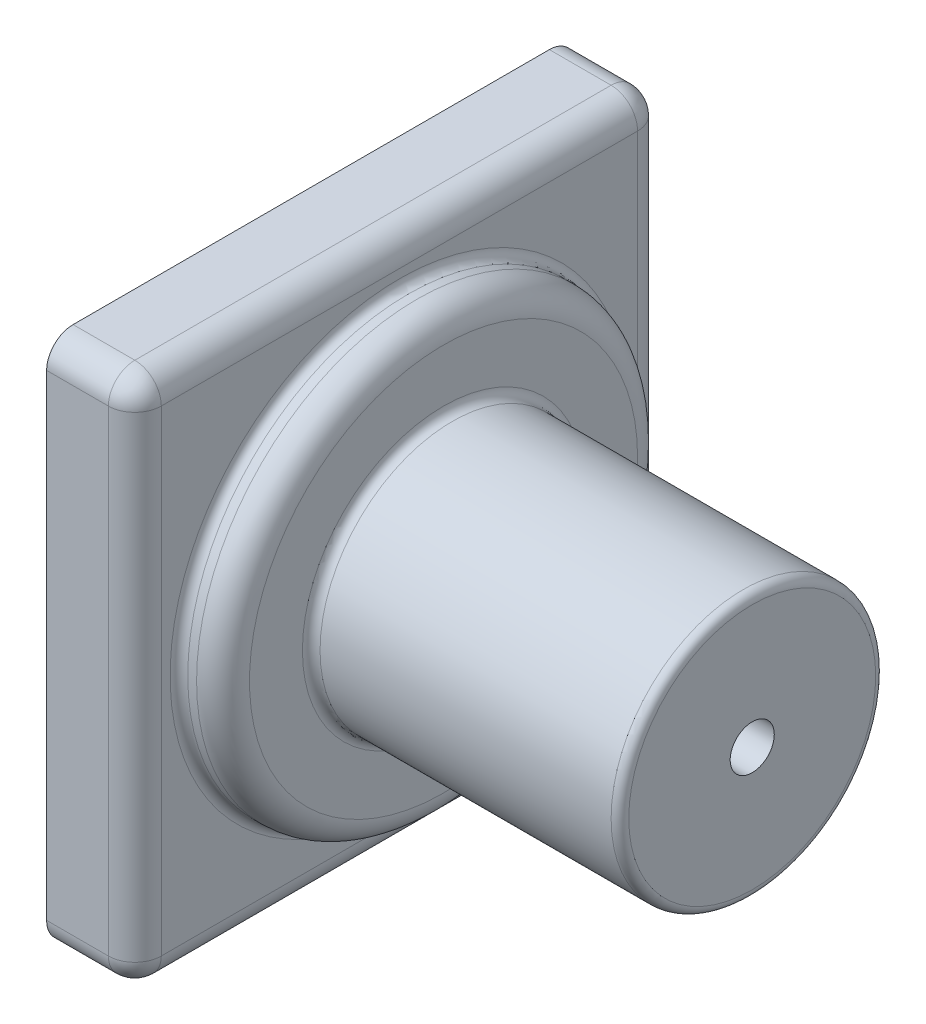
ISO-10303-21;
HEADER;
FILE_DESCRIPTION(('STEP AP214'),'2;1');
FILE_NAME('part.step','',(''),(''),'','','');
FILE_SCHEMA(('AUTOMOTIVE_DESIGN { 1 0 10303 214 1 1 1 1 }'));
ENDSEC;
DATA;
#1=APPLICATION_CONTEXT('core data for automotive mechanical design processes');
#2=APPLICATION_PROTOCOL_DEFINITION('international standard','automotive_design',2000,#1);
#3=PRODUCT_CONTEXT('',#1,'mechanical');
#4=PRODUCT('Part','Part','',(#3));
#5=PRODUCT_RELATED_PRODUCT_CATEGORY('part','',(#4));
#6=PRODUCT_DEFINITION_FORMATION('','',#4);
#7=PRODUCT_DEFINITION_CONTEXT('part definition',#1,'design');
#8=PRODUCT_DEFINITION('design','',#6,#7);
#9=PRODUCT_DEFINITION_SHAPE('','',#8);
#10=(LENGTH_UNIT() NAMED_UNIT(*) SI_UNIT(.MILLI.,.METRE.));
#11=(NAMED_UNIT(*) PLANE_ANGLE_UNIT() SI_UNIT($,.RADIAN.));
#12=(NAMED_UNIT(*) SI_UNIT($,.STERADIAN.) SOLID_ANGLE_UNIT());
#13=UNCERTAINTY_MEASURE_WITH_UNIT(LENGTH_MEASURE(1.E-05),#10,'distance_accuracy_value','');
#14=(GEOMETRIC_REPRESENTATION_CONTEXT(3) GLOBAL_UNCERTAINTY_ASSIGNED_CONTEXT((#13)) GLOBAL_UNIT_ASSIGNED_CONTEXT((#10,
#11,#12)) REPRESENTATION_CONTEXT('',''));
#15=CARTESIAN_POINT('',(0.,0.,0.));
#16=DIRECTION('',(0.,0.,1.));
#17=DIRECTION('',(1.,0.,0.));
#18=AXIS2_PLACEMENT_3D('',#15,#16,#17);
#19=CARTESIAN_POINT('',(10.,30.,-30.));
#20=DIRECTION('',(0.,0.,1.));
#21=DIRECTION('',(0.,-1.,0.));
#22=AXIS2_PLACEMENT_3D('',#19,#20,#21);
#23=PLANE('',#22);
#24=DIRECTION('',(0.,1.,0.));
#25=VECTOR('',#24,1.);
#26=CARTESIAN_POINT('',(0.,30.,-30.));
#27=LINE('',#26,#25);
#28=CARTESIAN_POINT('',(0.,-27.,-30.));
#29=VERTEX_POINT('',#28);
#30=CARTESIAN_POINT('',(0.,27.,-30.));
#31=VERTEX_POINT('',#30);
#32=EDGE_CURVE('E149',#29,#31,#27,.T.);
#33=ORIENTED_EDGE('',*,*,#32,.T.);
#34=DIRECTION('',(-1.,0.,0.));
#35=VECTOR('',#34,1.);
#36=CARTESIAN_POINT('',(10.,27.,-30.));
#37=LINE('',#36,#35);
#38=CARTESIAN_POINT('',(7.,27.,-30.));
#39=VERTEX_POINT('',#38);
#40=EDGE_CURVE('E124',#31,#39,#37,.F.);
#41=ORIENTED_EDGE('',*,*,#40,.T.);
#42=DIRECTION('',(0.,1.,0.));
#43=VECTOR('',#42,1.);
#44=CARTESIAN_POINT('',(7.,-30.,-30.));
#45=LINE('',#44,#43);
#46=CARTESIAN_POINT('',(7.,-27.,-30.));
#47=VERTEX_POINT('',#46);
#48=EDGE_CURVE('E130',#39,#47,#45,.F.);
#49=ORIENTED_EDGE('',*,*,#48,.T.);
#50=DIRECTION('',(-1.,0.,0.));
#51=VECTOR('',#50,1.);
#52=CARTESIAN_POINT('',(10.,-27.,-30.));
#53=LINE('',#52,#51);
#54=EDGE_CURVE('E176',#47,#29,#53,.T.);
#55=ORIENTED_EDGE('',*,*,#54,.T.);
#56=EDGE_LOOP('',(#33,#41,#49,#55));
#57=FACE_BOUND('',#56,.T.);
#58=ADVANCED_FACE('F41',(#57),#23,.F.);
#59=CARTESIAN_POINT('',(10.,30.,30.));
#60=DIRECTION('',(0.,-1.,0.));
#61=DIRECTION('',(0.,0.,-1.));
#62=AXIS2_PLACEMENT_3D('',#59,#60,#61);
#63=PLANE('',#62);
#64=DIRECTION('',(0.,0.,1.));
#65=VECTOR('',#64,1.);
#66=CARTESIAN_POINT('',(7.,30.,-30.));
#67=LINE('',#66,#65);
#68=CARTESIAN_POINT('',(7.,30.,27.));
#69=VERTEX_POINT('',#68);
#70=CARTESIAN_POINT('',(7.,30.,-27.));
#71=VERTEX_POINT('',#70);
#72=EDGE_CURVE('E139',#69,#71,#67,.F.);
#73=ORIENTED_EDGE('',*,*,#72,.T.);
#74=DIRECTION('',(-1.,0.,0.));
#75=VECTOR('',#74,1.);
#76=CARTESIAN_POINT('',(10.,30.,-27.));
#77=LINE('',#76,#75);
#78=CARTESIAN_POINT('',(0.,30.,-27.));
#79=VERTEX_POINT('',#78);
#80=EDGE_CURVE('E123',#71,#79,#77,.T.);
#81=ORIENTED_EDGE('',*,*,#80,.T.);
#82=DIRECTION('',(0.,0.,1.));
#83=VECTOR('',#82,1.);
#84=CARTESIAN_POINT('',(0.,30.,30.));
#85=LINE('',#84,#83);
#86=CARTESIAN_POINT('',(0.,30.,27.));
#87=VERTEX_POINT('',#86);
#88=EDGE_CURVE('E136',#79,#87,#85,.T.);
#89=ORIENTED_EDGE('',*,*,#88,.T.);
#90=DIRECTION('',(-1.,0.,0.));
#91=VECTOR('',#90,1.);
#92=CARTESIAN_POINT('',(10.,30.,27.));
#93=LINE('',#92,#91);
#94=EDGE_CURVE('E162',#87,#69,#93,.F.);
#95=ORIENTED_EDGE('',*,*,#94,.T.);
#96=EDGE_LOOP('',(#73,#81,#89,#95));
#97=FACE_BOUND('',#96,.T.);
#98=ADVANCED_FACE('F135',(#97),#63,.F.);
#99=CARTESIAN_POINT('',(10.,30.,30.));
#100=DIRECTION('',(0.,0.,-1.));
#101=DIRECTION('',(0.,1.,0.));
#102=AXIS2_PLACEMENT_3D('',#99,#100,#101);
#103=PLANE('',#102);
#104=DIRECTION('',(0.,-1.,0.));
#105=VECTOR('',#104,1.);
#106=CARTESIAN_POINT('',(0.,30.,30.));
#107=LINE('',#106,#105);
#108=CARTESIAN_POINT('',(0.,27.,30.));
#109=VERTEX_POINT('',#108);
#110=CARTESIAN_POINT('',(0.,-27.,30.));
#111=VERTEX_POINT('',#110);
#112=EDGE_CURVE('E148',#109,#111,#107,.T.);
#113=ORIENTED_EDGE('',*,*,#112,.T.);
#114=DIRECTION('',(-1.,0.,0.));
#115=VECTOR('',#114,1.);
#116=CARTESIAN_POINT('',(10.,-27.,30.));
#117=LINE('',#116,#115);
#118=CARTESIAN_POINT('',(7.,-27.,30.));
#119=VERTEX_POINT('',#118);
#120=EDGE_CURVE('E57',#111,#119,#117,.F.);
#121=ORIENTED_EDGE('',*,*,#120,.T.);
#122=DIRECTION('',(0.,-1.,0.));
#123=VECTOR('',#122,1.);
#124=CARTESIAN_POINT('',(7.,30.,30.));
#125=LINE('',#124,#123);
#126=CARTESIAN_POINT('',(7.,27.,30.));
#127=VERTEX_POINT('',#126);
#128=EDGE_CURVE('E62',#119,#127,#125,.F.);
#129=ORIENTED_EDGE('',*,*,#128,.T.);
#130=DIRECTION('',(-1.,0.,0.));
#131=VECTOR('',#130,1.);
#132=CARTESIAN_POINT('',(10.,27.,30.));
#133=LINE('',#132,#131);
#134=EDGE_CURVE('E203',#127,#109,#133,.T.);
#135=ORIENTED_EDGE('',*,*,#134,.T.);
#136=EDGE_LOOP('',(#113,#121,#129,#135));
#137=FACE_BOUND('',#136,.T.);
#138=ADVANCED_FACE('F302',(#137),#103,.F.);
#139=CARTESIAN_POINT('',(10.,-30.,30.));
#140=DIRECTION('',(0.,1.,0.));
#141=DIRECTION('',(0.,0.,1.));
#142=AXIS2_PLACEMENT_3D('',#139,#140,#141);
#143=PLANE('',#142);
#144=DIRECTION('',(0.,0.,-1.));
#145=VECTOR('',#144,1.);
#146=CARTESIAN_POINT('',(0.,-30.,30.));
#147=LINE('',#146,#145);
#148=CARTESIAN_POINT('',(0.,-30.,27.));
#149=VERTEX_POINT('',#148);
#150=CARTESIAN_POINT('',(0.,-30.,-27.));
#151=VERTEX_POINT('',#150);
#152=EDGE_CURVE('E153',#149,#151,#147,.T.);
#153=ORIENTED_EDGE('',*,*,#152,.T.);
#154=DIRECTION('',(-1.,0.,0.));
#155=VECTOR('',#154,1.);
#156=CARTESIAN_POINT('',(10.,-30.,-27.));
#157=LINE('',#156,#155);
#158=CARTESIAN_POINT('',(7.,-30.,-27.));
#159=VERTEX_POINT('',#158);
#160=EDGE_CURVE('E187',#151,#159,#157,.F.);
#161=ORIENTED_EDGE('',*,*,#160,.T.);
#162=DIRECTION('',(0.,0.,-1.));
#163=VECTOR('',#162,1.);
#164=CARTESIAN_POINT('',(7.,-30.,30.));
#165=LINE('',#164,#163);
#166=CARTESIAN_POINT('',(7.,-30.,27.));
#167=VERTEX_POINT('',#166);
#168=EDGE_CURVE('E184',#159,#167,#165,.F.);
#169=ORIENTED_EDGE('',*,*,#168,.T.);
#170=DIRECTION('',(-1.,0.,0.));
#171=VECTOR('',#170,1.);
#172=CARTESIAN_POINT('',(10.,-30.,27.));
#173=LINE('',#172,#171);
#174=EDGE_CURVE('E181',#167,#149,#173,.T.);
#175=ORIENTED_EDGE('',*,*,#174,.T.);
#176=EDGE_LOOP('',(#153,#161,#169,#175));
#177=FACE_BOUND('',#176,.T.);
#178=ADVANCED_FACE('F400',(#177),#143,.F.);
#179=CARTESIAN_POINT('',(10.,0.,0.));
#180=DIRECTION('',(1.,0.,0.));
#181=DIRECTION('',(0.,0.,-1.));
#182=AXIS2_PLACEMENT_3D('',#179,#180,#181);
#183=PLANE('',#182);
#184=CARTESIAN_POINT('',(10.,0.,0.));
#185=DIRECTION('',(1.,0.,0.));
#186=DIRECTION('',(0.,0.,-1.));
#187=AXIS2_PLACEMENT_3D('',#184,#185,#186);
#188=CIRCLE('',#187,26.);
#189=CARTESIAN_POINT('',(10.,0.,-26.));
#190=VERTEX_POINT('',#189);
#191=EDGE_CURVE('E11',#190,#190,#188,.F.);
#192=ORIENTED_EDGE('',*,*,#191,.T.);
#193=EDGE_LOOP('',(#192));
#194=FACE_BOUND('',#193,.T.);
#195=DIRECTION('',(0.,0.,-1.));
#196=VECTOR('',#195,1.);
#197=CARTESIAN_POINT('',(10.,-27.,-30.));
#198=LINE('',#197,#196);
#199=CARTESIAN_POINT('',(10.,-27.,27.));
#200=VERTEX_POINT('',#199);
#201=CARTESIAN_POINT('',(10.,-27.,-27.));
#202=VERTEX_POINT('',#201);
#203=EDGE_CURVE('E196',#200,#202,#198,.T.);
#204=ORIENTED_EDGE('',*,*,#203,.T.);
#205=DIRECTION('',(0.,1.,0.));
#206=VECTOR('',#205,1.);
#207=CARTESIAN_POINT('',(10.,30.,-27.));
#208=LINE('',#207,#206);
#209=CARTESIAN_POINT('',(10.,27.,-27.));
#210=VERTEX_POINT('',#209);
#211=EDGE_CURVE('E199',#202,#210,#208,.T.);
#212=ORIENTED_EDGE('',*,*,#211,.T.);
#213=DIRECTION('',(0.,0.,1.));
#214=VECTOR('',#213,1.);
#215=CARTESIAN_POINT('',(10.,27.,30.));
#216=LINE('',#215,#214);
#217=CARTESIAN_POINT('',(10.,27.,27.));
#218=VERTEX_POINT('',#217);
#219=EDGE_CURVE('E190',#210,#218,#216,.T.);
#220=ORIENTED_EDGE('',*,*,#219,.T.);
#221=DIRECTION('',(0.,-1.,0.));
#222=VECTOR('',#221,1.);
#223=CARTESIAN_POINT('',(10.,-30.,27.));
#224=LINE('',#223,#222);
#225=EDGE_CURVE('E193',#218,#200,#224,.T.);
#226=ORIENTED_EDGE('',*,*,#225,.T.);
#227=EDGE_LOOP('',(#204,#212,#220,#226));
#228=FACE_BOUND('',#227,.T.);
#229=ADVANCED_FACE('F397',(#194,#228),#183,.T.);
#230=CARTESIAN_POINT('',(0.,0.,0.));
#231=DIRECTION('',(1.,0.,0.));
#232=DIRECTION('',(0.,0.,-1.));
#233=AXIS2_PLACEMENT_3D('',#230,#231,#232);
#234=PLANE('',#233);
#235=ORIENTED_EDGE('',*,*,#88,.F.);
#236=CARTESIAN_POINT('',(0.,27.,-27.));
#237=DIRECTION('',(1.,0.,0.));
#238=DIRECTION('',(0.,0.,-1.));
#239=AXIS2_PLACEMENT_3D('',#236,#237,#238);
#240=CIRCLE('',#239,3.);
#241=EDGE_CURVE('E119',#79,#31,#240,.F.);
#242=ORIENTED_EDGE('',*,*,#241,.T.);
#243=ORIENTED_EDGE('',*,*,#32,.F.);
#244=CARTESIAN_POINT('',(0.,-27.,-27.));
#245=DIRECTION('',(1.,0.,0.));
#246=DIRECTION('',(0.,0.,-1.));
#247=AXIS2_PLACEMENT_3D('',#244,#245,#246);
#248=CIRCLE('',#247,3.);
#249=EDGE_CURVE('E131',#29,#151,#248,.F.);
#250=ORIENTED_EDGE('',*,*,#249,.T.);
#251=ORIENTED_EDGE('',*,*,#152,.F.);
#252=CARTESIAN_POINT('',(0.,-27.,27.));
#253=DIRECTION('',(1.,0.,0.));
#254=DIRECTION('',(0.,0.,-1.));
#255=AXIS2_PLACEMENT_3D('',#252,#253,#254);
#256=CIRCLE('',#255,3.);
#257=EDGE_CURVE('E169',#149,#111,#256,.F.);
#258=ORIENTED_EDGE('',*,*,#257,.T.);
#259=ORIENTED_EDGE('',*,*,#112,.F.);
#260=CARTESIAN_POINT('',(0.,27.,27.));
#261=DIRECTION('',(1.,0.,0.));
#262=DIRECTION('',(0.,0.,-1.));
#263=AXIS2_PLACEMENT_3D('',#260,#261,#262);
#264=CIRCLE('',#263,3.);
#265=EDGE_CURVE('E142',#109,#87,#264,.F.);
#266=ORIENTED_EDGE('',*,*,#265,.T.);
#267=EDGE_LOOP('',(#235,#242,#243,#250,#251,#258,#259,#266));
#268=FACE_BOUND('',#267,.T.);
#269=ADVANCED_FACE('F144',(#268),#234,.F.);
#270=CARTESIAN_POINT('',(15.,0.,0.));
#271=DIRECTION('',(-1.,0.,0.));
#272=DIRECTION('',(0.,0.,1.));
#273=AXIS2_PLACEMENT_3D('',#270,#271,#272);
#274=CYLINDRICAL_SURFACE('',#273,25.);
#275=CARTESIAN_POINT('',(11.,0.,0.));
#276=DIRECTION('',(1.,0.,0.));
#277=DIRECTION('',(0.,0.,-1.));
#278=AXIS2_PLACEMENT_3D('',#275,#276,#277);
#279=CIRCLE('',#278,25.);
#280=CARTESIAN_POINT('',(11.,0.,-25.));
#281=VERTEX_POINT('',#280);
#282=EDGE_CURVE('E50',#281,#281,#279,.T.);
#283=ORIENTED_EDGE('',*,*,#282,.T.);
#284=EDGE_LOOP('',(#283));
#285=FACE_BOUND('',#284,.T.);
#286=CARTESIAN_POINT('',(12.,0.,0.));
#287=DIRECTION('',(1.,0.,0.));
#288=DIRECTION('',(0.,0.,-1.));
#289=AXIS2_PLACEMENT_3D('',#286,#287,#288);
#290=CIRCLE('',#289,25.);
#291=CARTESIAN_POINT('',(12.,0.,-25.));
#292=VERTEX_POINT('',#291);
#293=EDGE_CURVE('E261',#292,#292,#290,.F.);
#294=ORIENTED_EDGE('',*,*,#293,.T.);
#295=EDGE_LOOP('',(#294));
#296=FACE_BOUND('',#295,.T.);
#297=ADVANCED_FACE('F284',(#285,#296),#274,.T.);
#298=CARTESIAN_POINT('',(15.,0.,0.));
#299=DIRECTION('',(1.,0.,0.));
#300=DIRECTION('',(0.,0.,-1.));
#301=AXIS2_PLACEMENT_3D('',#298,#299,#300);
#302=PLANE('',#301);
#303=CARTESIAN_POINT('',(15.,0.,0.));
#304=DIRECTION('',(1.,0.,0.));
#305=DIRECTION('',(0.,0.,-1.));
#306=AXIS2_PLACEMENT_3D('',#303,#304,#305);
#307=CIRCLE('',#306,16.);
#308=CARTESIAN_POINT('',(15.,0.,-16.));
#309=VERTEX_POINT('',#308);
#310=EDGE_CURVE('E277',#309,#309,#307,.F.);
#311=ORIENTED_EDGE('',*,*,#310,.T.);
#312=EDGE_LOOP('',(#311));
#313=FACE_BOUND('',#312,.T.);
#314=CARTESIAN_POINT('',(15.,0.,0.));
#315=DIRECTION('',(1.,0.,0.));
#316=DIRECTION('',(0.,0.,-1.));
#317=AXIS2_PLACEMENT_3D('',#314,#315,#316);
#318=CIRCLE('',#317,22.);
#319=CARTESIAN_POINT('',(15.,0.,-22.));
#320=VERTEX_POINT('',#319);
#321=EDGE_CURVE('E210',#320,#320,#318,.T.);
#322=ORIENTED_EDGE('',*,*,#321,.T.);
#323=EDGE_LOOP('',(#322));
#324=FACE_BOUND('',#323,.T.);
#325=ADVANCED_FACE('F390',(#313,#324),#302,.T.);
#326=CARTESIAN_POINT('',(50.,0.,0.));
#327=DIRECTION('',(-1.,0.,0.));
#328=DIRECTION('',(0.,0.,1.));
#329=AXIS2_PLACEMENT_3D('',#326,#327,#328);
#330=CYLINDRICAL_SURFACE('',#329,15.);
#331=CARTESIAN_POINT('',(49.,0.,0.));
#332=DIRECTION('',(1.,0.,0.));
#333=DIRECTION('',(0.,0.,-1.));
#334=AXIS2_PLACEMENT_3D('',#331,#332,#333);
#335=CIRCLE('',#334,15.);
#336=CARTESIAN_POINT('',(49.,0.,-15.));
#337=VERTEX_POINT('',#336);
#338=EDGE_CURVE('E273',#337,#337,#335,.F.);
#339=ORIENTED_EDGE('',*,*,#338,.T.);
#340=EDGE_LOOP('',(#339));
#341=FACE_BOUND('',#340,.T.);
#342=CARTESIAN_POINT('',(16.,0.,0.));
#343=DIRECTION('',(1.,0.,0.));
#344=DIRECTION('',(0.,0.,-1.));
#345=AXIS2_PLACEMENT_3D('',#342,#343,#344);
#346=CIRCLE('',#345,15.);
#347=CARTESIAN_POINT('',(16.,0.,-15.));
#348=VERTEX_POINT('',#347);
#349=EDGE_CURVE('E269',#348,#348,#346,.T.);
#350=ORIENTED_EDGE('',*,*,#349,.T.);
#351=EDGE_LOOP('',(#350));
#352=FACE_BOUND('',#351,.T.);
#353=ADVANCED_FACE('F369',(#341,#352),#330,.T.);
#354=CARTESIAN_POINT('',(50.,0.,0.));
#355=DIRECTION('',(1.,0.,0.));
#356=DIRECTION('',(0.,0.,-1.));
#357=AXIS2_PLACEMENT_3D('',#354,#355,#356);
#358=PLANE('',#357);
#359=CARTESIAN_POINT('',(50.,0.,0.));
#360=DIRECTION('',(1.,0.,0.));
#361=DIRECTION('',(0.,0.,-1.));
#362=AXIS2_PLACEMENT_3D('',#359,#360,#361);
#363=CIRCLE('',#362,14.);
#364=CARTESIAN_POINT('',(50.,0.,-14.));
#365=VERTEX_POINT('',#364);
#366=EDGE_CURVE('E265',#365,#365,#363,.T.);
#367=ORIENTED_EDGE('',*,*,#366,.T.);
#368=EDGE_LOOP('',(#367));
#369=FACE_BOUND('',#368,.T.);
#370=CARTESIAN_POINT('',(50.,0.,0.));
#371=DIRECTION('',(1.,0.,0.));
#372=DIRECTION('',(0.,0.,-1.));
#373=AXIS2_PLACEMENT_3D('',#370,#371,#372);
#374=CIRCLE('',#373,2.5);
#375=CARTESIAN_POINT('',(50.,0.,-2.5));
#376=VERTEX_POINT('',#375);
#377=EDGE_CURVE('E257',#376,#376,#374,.T.);
#378=ORIENTED_EDGE('',*,*,#377,.F.);
#379=EDGE_LOOP('',(#378));
#380=FACE_BOUND('',#379,.T.);
#381=ADVANCED_FACE('F365',(#369,#380),#358,.T.);
#382=CARTESIAN_POINT('',(45.,0.,0.));
#383=DIRECTION('',(1.,0.,0.));
#384=DIRECTION('',(0.,0.,-1.));
#385=AXIS2_PLACEMENT_3D('',#382,#383,#384);
#386=CYLINDRICAL_SURFACE('',#385,2.5);
#387=CARTESIAN_POINT('',(45.,0.,0.));
#388=DIRECTION('',(1.,0.,0.));
#389=DIRECTION('',(0.,0.,-1.));
#390=AXIS2_PLACEMENT_3D('',#387,#388,#389);
#391=CIRCLE('',#390,2.5);
#392=CARTESIAN_POINT('',(45.,0.,-2.5));
#393=VERTEX_POINT('',#392);
#394=EDGE_CURVE('E155',#393,#393,#391,.T.);
#395=ORIENTED_EDGE('',*,*,#394,.F.);
#396=EDGE_LOOP('',(#395));
#397=FACE_BOUND('',#396,.T.);
#398=ORIENTED_EDGE('',*,*,#377,.T.);
#399=EDGE_LOOP('',(#398));
#400=FACE_BOUND('',#399,.T.);
#401=ADVANCED_FACE('F368',(#397,#400),#386,.F.);
#402=CARTESIAN_POINT('',(45.,0.,0.));
#403=DIRECTION('',(1.,0.,0.));
#404=DIRECTION('',(0.,0.,-1.));
#405=AXIS2_PLACEMENT_3D('',#402,#403,#404);
#406=PLANE('',#405);
#407=ORIENTED_EDGE('',*,*,#394,.T.);
#408=EDGE_LOOP('',(#407));
#409=FACE_BOUND('',#408,.T.);
#410=ADVANCED_FACE('F352',(#409),#406,.T.);
#411=CARTESIAN_POINT('',(10.,-27.,27.));
#412=DIRECTION('',(-1.,0.,0.));
#413=DIRECTION('',(0.,0.,1.));
#414=AXIS2_PLACEMENT_3D('',#411,#412,#413);
#415=CYLINDRICAL_SURFACE('',#414,3.);
#416=CARTESIAN_POINT('',(7.,-27.,27.));
#417=DIRECTION('',(1.,0.,0.));
#418=DIRECTION('',(0.,0.,-1.));
#419=AXIS2_PLACEMENT_3D('',#416,#417,#418);
#420=CIRCLE('',#419,3.);
#421=EDGE_CURVE('E253',#119,#167,#420,.T.);
#422=ORIENTED_EDGE('',*,*,#421,.F.);
#423=ORIENTED_EDGE('',*,*,#120,.F.);
#424=ORIENTED_EDGE('',*,*,#257,.F.);
#425=ORIENTED_EDGE('',*,*,#174,.F.);
#426=EDGE_LOOP('',(#422,#423,#424,#425));
#427=FACE_BOUND('',#426,.T.);
#428=ADVANCED_FACE('F348',(#427),#415,.T.);
#429=CARTESIAN_POINT('',(7.,-27.,27.));
#430=DIRECTION('',(0.,0.,1.));
#431=DIRECTION('',(1.,0.,0.));
#432=AXIS2_PLACEMENT_3D('',#429,#430,#431);
#433=SPHERICAL_SURFACE('',#432,3.);
#434=CARTESIAN_POINT('',(7.,-27.,27.));
#435=DIRECTION('',(0.,-1.,0.));
#436=DIRECTION('',(0.,0.,-1.));
#437=AXIS2_PLACEMENT_3D('',#434,#435,#436);
#438=CIRCLE('',#437,3.);
#439=EDGE_CURVE('E245',#119,#200,#438,.F.);
#440=ORIENTED_EDGE('',*,*,#439,.F.);
#441=ORIENTED_EDGE('',*,*,#421,.T.);
#442=CARTESIAN_POINT('',(7.,-27.,27.));
#443=DIRECTION('',(0.,0.,1.));
#444=DIRECTION('',(1.,0.,0.));
#445=AXIS2_PLACEMENT_3D('',#442,#443,#444);
#446=CIRCLE('',#445,3.);
#447=EDGE_CURVE('E249',#200,#167,#446,.F.);
#448=ORIENTED_EDGE('',*,*,#447,.F.);
#449=EDGE_LOOP('',(#440,#441,#448));
#450=FACE_BOUND('',#449,.T.);
#451=ADVANCED_FACE('F344',(#450),#433,.T.);
#452=CARTESIAN_POINT('',(10.,-27.,-27.));
#453=DIRECTION('',(-1.,0.,0.));
#454=DIRECTION('',(0.,0.,1.));
#455=AXIS2_PLACEMENT_3D('',#452,#453,#454);
#456=CYLINDRICAL_SURFACE('',#455,3.);
#457=ORIENTED_EDGE('',*,*,#249,.F.);
#458=ORIENTED_EDGE('',*,*,#54,.F.);
#459=CARTESIAN_POINT('',(7.,-27.,-27.));
#460=DIRECTION('',(1.,0.,0.));
#461=DIRECTION('',(0.,0.,-1.));
#462=AXIS2_PLACEMENT_3D('',#459,#460,#461);
#463=CIRCLE('',#462,3.);
#464=EDGE_CURVE('E241',#159,#47,#463,.T.);
#465=ORIENTED_EDGE('',*,*,#464,.F.);
#466=ORIENTED_EDGE('',*,*,#160,.F.);
#467=EDGE_LOOP('',(#457,#458,#465,#466));
#468=FACE_BOUND('',#467,.T.);
#469=ADVANCED_FACE('F340',(#468),#456,.T.);
#470=CARTESIAN_POINT('',(7.,-27.,0.));
#471=DIRECTION('',(0.,0.,1.));
#472=DIRECTION('',(1.,0.,0.));
#473=AXIS2_PLACEMENT_3D('',#470,#471,#472);
#474=CYLINDRICAL_SURFACE('',#473,3.);
#475=ORIENTED_EDGE('',*,*,#447,.T.);
#476=ORIENTED_EDGE('',*,*,#168,.F.);
#477=CARTESIAN_POINT('',(7.,-27.,-27.));
#478=DIRECTION('',(0.,0.,-1.));
#479=DIRECTION('',(-1.,0.,0.));
#480=AXIS2_PLACEMENT_3D('',#477,#478,#479);
#481=CIRCLE('',#480,3.);
#482=EDGE_CURVE('E237',#202,#159,#481,.T.);
#483=ORIENTED_EDGE('',*,*,#482,.F.);
#484=ORIENTED_EDGE('',*,*,#203,.F.);
#485=EDGE_LOOP('',(#475,#476,#483,#484));
#486=FACE_BOUND('',#485,.T.);
#487=ADVANCED_FACE('F336',(#486),#474,.T.);
#488=CARTESIAN_POINT('',(7.,0.,27.));
#489=DIRECTION('',(0.,1.,0.));
#490=DIRECTION('',(0.,0.,1.));
#491=AXIS2_PLACEMENT_3D('',#488,#489,#490);
#492=CYLINDRICAL_SURFACE('',#491,3.);
#493=ORIENTED_EDGE('',*,*,#439,.T.);
#494=ORIENTED_EDGE('',*,*,#225,.F.);
#495=CARTESIAN_POINT('',(7.,27.,27.));
#496=DIRECTION('',(0.,1.,0.));
#497=DIRECTION('',(0.,0.,1.));
#498=AXIS2_PLACEMENT_3D('',#495,#496,#497);
#499=CIRCLE('',#498,3.);
#500=EDGE_CURVE('E233',#127,#218,#499,.T.);
#501=ORIENTED_EDGE('',*,*,#500,.F.);
#502=ORIENTED_EDGE('',*,*,#128,.F.);
#503=EDGE_LOOP('',(#493,#494,#501,#502));
#504=FACE_BOUND('',#503,.T.);
#505=ADVANCED_FACE('F332',(#504),#492,.T.);
#506=CARTESIAN_POINT('',(10.,27.,27.));
#507=DIRECTION('',(-1.,0.,0.));
#508=DIRECTION('',(0.,0.,1.));
#509=AXIS2_PLACEMENT_3D('',#506,#507,#508);
#510=CYLINDRICAL_SURFACE('',#509,3.);
#511=ORIENTED_EDGE('',*,*,#265,.F.);
#512=ORIENTED_EDGE('',*,*,#134,.F.);
#513=CARTESIAN_POINT('',(7.,27.,27.));
#514=DIRECTION('',(1.,0.,0.));
#515=DIRECTION('',(0.,0.,-1.));
#516=AXIS2_PLACEMENT_3D('',#513,#514,#515);
#517=CIRCLE('',#516,3.);
#518=EDGE_CURVE('E229',#69,#127,#517,.T.);
#519=ORIENTED_EDGE('',*,*,#518,.F.);
#520=ORIENTED_EDGE('',*,*,#94,.F.);
#521=EDGE_LOOP('',(#511,#512,#519,#520));
#522=FACE_BOUND('',#521,.T.);
#523=ADVANCED_FACE('F328',(#522),#510,.T.);
#524=CARTESIAN_POINT('',(7.,-27.,-27.));
#525=DIRECTION('',(0.,0.,1.));
#526=DIRECTION('',(1.,0.,0.));
#527=AXIS2_PLACEMENT_3D('',#524,#525,#526);
#528=SPHERICAL_SURFACE('',#527,3.);
#529=ORIENTED_EDGE('',*,*,#482,.T.);
#530=ORIENTED_EDGE('',*,*,#464,.T.);
#531=CARTESIAN_POINT('',(7.,-27.,-27.));
#532=DIRECTION('',(0.,-1.,0.));
#533=DIRECTION('',(1.,0.,0.));
#534=AXIS2_PLACEMENT_3D('',#531,#532,#533);
#535=CIRCLE('',#534,3.);
#536=EDGE_CURVE('E225',#202,#47,#535,.F.);
#537=ORIENTED_EDGE('',*,*,#536,.F.);
#538=EDGE_LOOP('',(#529,#530,#537));
#539=FACE_BOUND('',#538,.T.);
#540=ADVANCED_FACE('F324',(#539),#528,.T.);
#541=CARTESIAN_POINT('',(7.,27.,27.));
#542=DIRECTION('',(0.,0.,1.));
#543=DIRECTION('',(1.,0.,0.));
#544=AXIS2_PLACEMENT_3D('',#541,#542,#543);
#545=SPHERICAL_SURFACE('',#544,3.);
#546=ORIENTED_EDGE('',*,*,#518,.T.);
#547=ORIENTED_EDGE('',*,*,#500,.T.);
#548=CARTESIAN_POINT('',(7.,27.,27.));
#549=DIRECTION('',(0.,0.,1.));
#550=DIRECTION('',(1.,0.,0.));
#551=AXIS2_PLACEMENT_3D('',#548,#549,#550);
#552=CIRCLE('',#551,3.);
#553=EDGE_CURVE('E221',#69,#218,#552,.F.);
#554=ORIENTED_EDGE('',*,*,#553,.F.);
#555=EDGE_LOOP('',(#546,#547,#554));
#556=FACE_BOUND('',#555,.T.);
#557=ADVANCED_FACE('F320',(#556),#545,.T.);
#558=CARTESIAN_POINT('',(7.,0.,-27.));
#559=DIRECTION('',(0.,-1.,0.));
#560=DIRECTION('',(0.,0.,-1.));
#561=AXIS2_PLACEMENT_3D('',#558,#559,#560);
#562=CYLINDRICAL_SURFACE('',#561,3.);
#563=ORIENTED_EDGE('',*,*,#536,.T.);
#564=ORIENTED_EDGE('',*,*,#48,.F.);
#565=CARTESIAN_POINT('',(7.,27.,-27.));
#566=DIRECTION('',(0.,1.,0.));
#567=DIRECTION('',(0.,0.,1.));
#568=AXIS2_PLACEMENT_3D('',#565,#566,#567);
#569=CIRCLE('',#568,3.);
#570=EDGE_CURVE('E217',#210,#39,#569,.T.);
#571=ORIENTED_EDGE('',*,*,#570,.F.);
#572=ORIENTED_EDGE('',*,*,#211,.F.);
#573=EDGE_LOOP('',(#563,#564,#571,#572));
#574=FACE_BOUND('',#573,.T.);
#575=ADVANCED_FACE('F316',(#574),#562,.T.);
#576=CARTESIAN_POINT('',(7.,27.,0.));
#577=DIRECTION('',(0.,0.,-1.));
#578=DIRECTION('',(-1.,0.,0.));
#579=AXIS2_PLACEMENT_3D('',#576,#577,#578);
#580=CYLINDRICAL_SURFACE('',#579,3.);
#581=ORIENTED_EDGE('',*,*,#553,.T.);
#582=ORIENTED_EDGE('',*,*,#219,.F.);
#583=CARTESIAN_POINT('',(7.,27.,-27.));
#584=DIRECTION('',(0.,0.,-1.));
#585=DIRECTION('',(-1.,0.,0.));
#586=AXIS2_PLACEMENT_3D('',#583,#584,#585);
#587=CIRCLE('',#586,3.);
#588=EDGE_CURVE('E214',#71,#210,#587,.T.);
#589=ORIENTED_EDGE('',*,*,#588,.F.);
#590=ORIENTED_EDGE('',*,*,#72,.F.);
#591=EDGE_LOOP('',(#581,#582,#589,#590));
#592=FACE_BOUND('',#591,.T.);
#593=ADVANCED_FACE('F312',(#592),#580,.T.);
#594=CARTESIAN_POINT('',(7.,27.,-27.));
#595=DIRECTION('',(0.,0.,1.));
#596=DIRECTION('',(1.,0.,0.));
#597=AXIS2_PLACEMENT_3D('',#594,#595,#596);
#598=SPHERICAL_SURFACE('',#597,3.);
#599=ORIENTED_EDGE('',*,*,#588,.T.);
#600=ORIENTED_EDGE('',*,*,#570,.T.);
#601=CARTESIAN_POINT('',(7.,27.,-27.));
#602=DIRECTION('',(1.,0.,0.));
#603=DIRECTION('',(0.,0.,-1.));
#604=AXIS2_PLACEMENT_3D('',#601,#602,#603);
#605=CIRCLE('',#604,3.);
#606=EDGE_CURVE('E211',#71,#39,#605,.F.);
#607=ORIENTED_EDGE('',*,*,#606,.F.);
#608=EDGE_LOOP('',(#599,#600,#607));
#609=FACE_BOUND('',#608,.T.);
#610=ADVANCED_FACE('F309',(#609),#598,.T.);
#611=CARTESIAN_POINT('',(10.,27.,-27.));
#612=DIRECTION('',(-1.,0.,0.));
#613=DIRECTION('',(0.,0.,1.));
#614=AXIS2_PLACEMENT_3D('',#611,#612,#613);
#615=CYLINDRICAL_SURFACE('',#614,3.);
#616=ORIENTED_EDGE('',*,*,#606,.T.);
#617=ORIENTED_EDGE('',*,*,#40,.F.);
#618=ORIENTED_EDGE('',*,*,#241,.F.);
#619=ORIENTED_EDGE('',*,*,#80,.F.);
#620=EDGE_LOOP('',(#616,#617,#618,#619));
#621=FACE_BOUND('',#620,.T.);
#622=ADVANCED_FACE('F122',(#621),#615,.T.);
#623=CARTESIAN_POINT('',(12.,0.,0.));
#624=DIRECTION('',(1.,0.,0.));
#625=DIRECTION('',(0.,0.,-1.));
#626=AXIS2_PLACEMENT_3D('',#623,#624,#625);
#627=TOROIDAL_SURFACE('',#626,22.,3.);
#628=ORIENTED_EDGE('',*,*,#293,.F.);
#629=EDGE_LOOP('',(#628));
#630=FACE_BOUND('',#629,.T.);
#631=ORIENTED_EDGE('',*,*,#321,.F.);
#632=EDGE_LOOP('',(#631));
#633=FACE_BOUND('',#632,.T.);
#634=ADVANCED_FACE('F308',(#630,#633),#627,.T.);
#635=CARTESIAN_POINT('',(49.,0.,0.));
#636=DIRECTION('',(1.,0.,0.));
#637=DIRECTION('',(0.,0.,-1.));
#638=AXIS2_PLACEMENT_3D('',#635,#636,#637);
#639=TOROIDAL_SURFACE('',#638,14.,1.);
#640=ORIENTED_EDGE('',*,*,#338,.F.);
#641=EDGE_LOOP('',(#640));
#642=FACE_BOUND('',#641,.T.);
#643=ORIENTED_EDGE('',*,*,#366,.F.);
#644=EDGE_LOOP('',(#643));
#645=FACE_BOUND('',#644,.T.);
#646=ADVANCED_FACE('F293',(#642,#645),#639,.T.);
#647=CARTESIAN_POINT('',(16.,0.,0.));
#648=DIRECTION('',(1.,0.,0.));
#649=DIRECTION('',(0.,0.,-1.));
#650=AXIS2_PLACEMENT_3D('',#647,#648,#649);
#651=TOROIDAL_SURFACE('',#650,16.,1.);
#652=ORIENTED_EDGE('',*,*,#310,.F.);
#653=EDGE_LOOP('',(#652));
#654=FACE_BOUND('',#653,.T.);
#655=ORIENTED_EDGE('',*,*,#349,.F.);
#656=EDGE_LOOP('',(#655));
#657=FACE_BOUND('',#656,.T.);
#658=ADVANCED_FACE('F288',(#654,#657),#651,.F.);
#659=CARTESIAN_POINT('',(11.,0.,0.));
#660=DIRECTION('',(1.,0.,0.));
#661=DIRECTION('',(0.,0.,-1.));
#662=AXIS2_PLACEMENT_3D('',#659,#660,#661);
#663=TOROIDAL_SURFACE('',#662,26.,1.);
#664=ORIENTED_EDGE('',*,*,#191,.F.);
#665=EDGE_LOOP('',(#664));
#666=FACE_BOUND('',#665,.T.);
#667=ORIENTED_EDGE('',*,*,#282,.F.);
#668=EDGE_LOOP('',(#667));
#669=FACE_BOUND('',#668,.T.);
#670=ADVANCED_FACE('F43',(#666,#669),#663,.F.);
#671=CLOSED_SHELL('',(#58,#98,#138,#178,#229,#269,#297,#325,#353,#381,#401,#410,#428,#451,#469,
#487,#505,#523,#540,#557,#575,#593,#610,#622,#634,#646,#658,#670));
#672=MANIFOLD_SOLID_BREP('B2',#671);
#673=ADVANCED_BREP_SHAPE_REPRESENTATION('',(#18,#672),#14);
#674=SHAPE_DEFINITION_REPRESENTATION(#9,#673);
ENDSEC;
END-ISO-10303-21;
